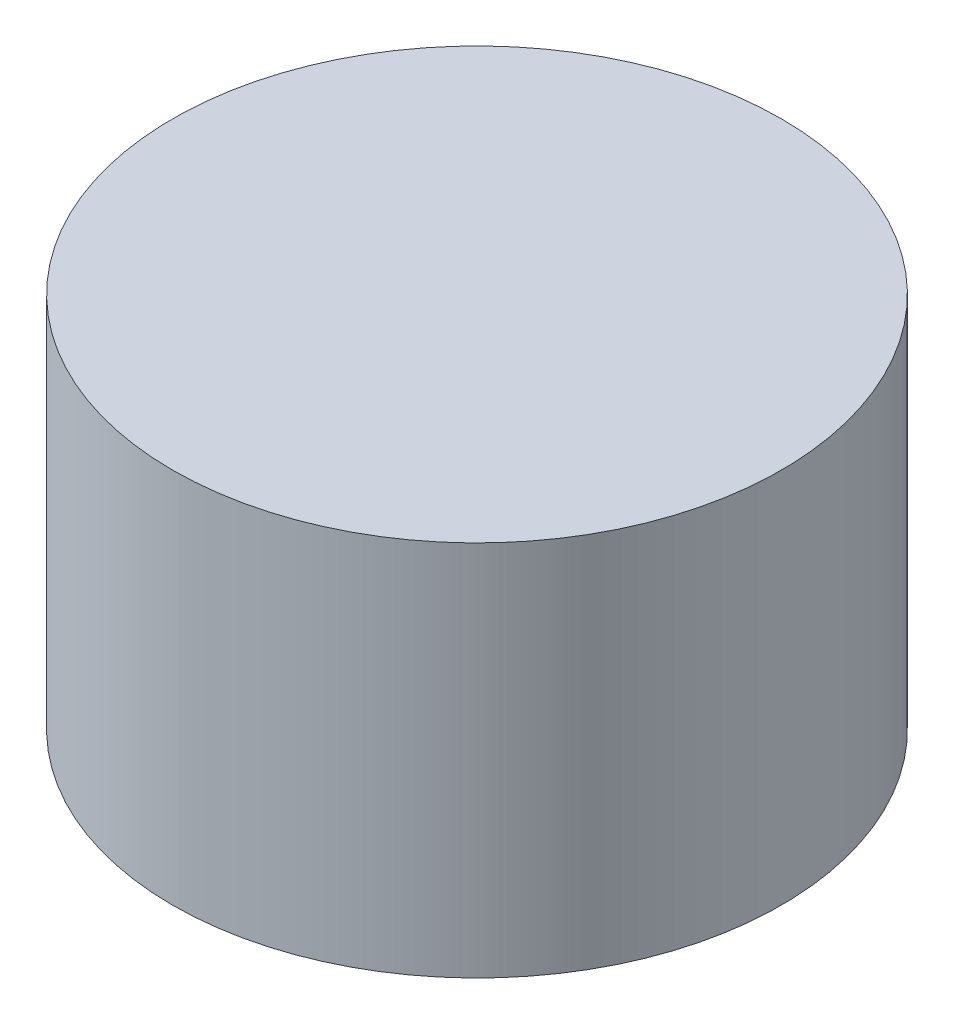
ISO-10303-21;
HEADER;
FILE_DESCRIPTION(('STEP AP214'),'2;1');
FILE_NAME('part.step','',(''),(''),'','','');
FILE_SCHEMA(('AUTOMOTIVE_DESIGN { 1 0 10303 214 1 1 1 1 }'));
ENDSEC;
DATA;
#1=APPLICATION_CONTEXT('core data for automotive mechanical design processes');
#2=APPLICATION_PROTOCOL_DEFINITION('international standard','automotive_design',2000,#1);
#3=PRODUCT_CONTEXT('',#1,'mechanical');
#4=PRODUCT('Part','Part','',(#3));
#5=PRODUCT_RELATED_PRODUCT_CATEGORY('part','',(#4));
#6=PRODUCT_DEFINITION_FORMATION('','',#4);
#7=PRODUCT_DEFINITION_CONTEXT('part definition',#1,'design');
#8=PRODUCT_DEFINITION('design','',#6,#7);
#9=PRODUCT_DEFINITION_SHAPE('','',#8);
#10=(LENGTH_UNIT() NAMED_UNIT(*) SI_UNIT(.MILLI.,.METRE.));
#11=(NAMED_UNIT(*) PLANE_ANGLE_UNIT() SI_UNIT($,.RADIAN.));
#12=(NAMED_UNIT(*) SI_UNIT($,.STERADIAN.) SOLID_ANGLE_UNIT());
#13=UNCERTAINTY_MEASURE_WITH_UNIT(LENGTH_MEASURE(1.E-05),#10,'distance_accuracy_value','');
#14=(GEOMETRIC_REPRESENTATION_CONTEXT(3) GLOBAL_UNCERTAINTY_ASSIGNED_CONTEXT((#13)) GLOBAL_UNIT_ASSIGNED_CONTEXT((#10,
#11,#12)) REPRESENTATION_CONTEXT('',''));
#15=CARTESIAN_POINT('',(0.,0.,0.));
#16=DIRECTION('',(0.,0.,1.));
#17=DIRECTION('',(1.,0.,0.));
#18=AXIS2_PLACEMENT_3D('',#15,#16,#17);
#19=CARTESIAN_POINT('',(0.,13.,0.));
#20=DIRECTION('',(0.,-1.,0.));
#21=DIRECTION('',(0.,0.,-1.));
#22=AXIS2_PLACEMENT_3D('',#19,#20,#21);
#23=CYLINDRICAL_SURFACE('',#22,10.5);
#24=CARTESIAN_POINT('',(0.,13.,0.));
#25=DIRECTION('',(0.,1.,0.));
#26=DIRECTION('',(0.,0.,1.));
#27=AXIS2_PLACEMENT_3D('',#24,#25,#26);
#28=CIRCLE('',#27,10.5);
#29=CARTESIAN_POINT('',(0.,13.,10.5));
#30=VERTEX_POINT('',#29);
#31=EDGE_CURVE('E10',#30,#30,#28,.T.);
#32=ORIENTED_EDGE('',*,*,#31,.F.);
#33=EDGE_LOOP('',(#32));
#34=FACE_BOUND('',#33,.T.);
#35=CARTESIAN_POINT('',(0.,0.,0.));
#36=DIRECTION('',(0.,1.,0.));
#37=DIRECTION('',(0.,0.,1.));
#38=AXIS2_PLACEMENT_3D('',#35,#36,#37);
#39=CIRCLE('',#38,10.5);
#40=CARTESIAN_POINT('',(0.,0.,10.5));
#41=VERTEX_POINT('',#40);
#42=EDGE_CURVE('E41',#41,#41,#39,.T.);
#43=ORIENTED_EDGE('',*,*,#42,.T.);
#44=EDGE_LOOP('',(#43));
#45=FACE_BOUND('',#44,.T.);
#46=ADVANCED_FACE('F34',(#34,#45),#23,.T.);
#47=CARTESIAN_POINT('',(0.,13.,0.));
#48=DIRECTION('',(0.,1.,0.));
#49=DIRECTION('',(0.,0.,1.));
#50=AXIS2_PLACEMENT_3D('',#47,#48,#49);
#51=PLANE('',#50);
#52=ORIENTED_EDGE('',*,*,#31,.T.);
#53=EDGE_LOOP('',(#52));
#54=FACE_BOUND('',#53,.T.);
#55=ADVANCED_FACE('F67',(#54),#51,.T.);
#56=CARTESIAN_POINT('',(0.,0.,0.));
#57=DIRECTION('',(0.,1.,0.));
#58=DIRECTION('',(0.,0.,1.));
#59=AXIS2_PLACEMENT_3D('',#56,#57,#58);
#60=PLANE('',#59);
#61=CARTESIAN_POINT('',(0.,0.,0.));
#62=DIRECTION('',(0.,1.,0.));
#63=DIRECTION('',(0.,0.,1.));
#64=AXIS2_PLACEMENT_3D('',#61,#62,#63);
#65=CIRCLE('',#64,7.5);
#66=CARTESIAN_POINT('',(0.,0.,7.5));
#67=VERTEX_POINT('',#66);
#68=EDGE_CURVE('E37',#67,#67,#65,.T.);
#69=ORIENTED_EDGE('',*,*,#68,.T.);
#70=EDGE_LOOP('',(#69));
#71=FACE_BOUND('',#70,.T.);
#72=ORIENTED_EDGE('',*,*,#42,.F.);
#73=EDGE_LOOP('',(#72));
#74=FACE_BOUND('',#73,.T.);
#75=ADVANCED_FACE('F54',(#71,#74),#60,.F.);
#76=CARTESIAN_POINT('',(0.,0.0490987680048355,0.));
#77=DIRECTION('',(0.,-1.,0.));
#78=DIRECTION('',(0.,0.,-1.));
#79=AXIS2_PLACEMENT_3D('',#76,#77,#78);
#80=CYLINDRICAL_SURFACE('',#79,7.5);
#81=CARTESIAN_POINT('',(0.,8.174080160432,0.));
#82=DIRECTION('',(0.,-1.,0.));
#83=DIRECTION('',(0.,0.,-1.));
#84=AXIS2_PLACEMENT_3D('',#81,#82,#83);
#85=CIRCLE('',#84,7.5);
#86=CARTESIAN_POINT('',(0.,8.174080160432,-7.5));
#87=VERTEX_POINT('',#86);
#88=EDGE_CURVE('E47',#87,#87,#85,.T.);
#89=ORIENTED_EDGE('',*,*,#88,.F.);
#90=EDGE_LOOP('',(#89));
#91=FACE_BOUND('',#90,.T.);
#92=ORIENTED_EDGE('',*,*,#68,.F.);
#93=EDGE_LOOP('',(#92));
#94=FACE_BOUND('',#93,.T.);
#95=ADVANCED_FACE('F57',(#91,#94),#80,.F.);
#96=CARTESIAN_POINT('',(0.,8.174080160432,0.));
#97=DIRECTION('',(0.,1.,0.));
#98=DIRECTION('',(0.,0.,1.));
#99=AXIS2_PLACEMENT_3D('',#96,#97,#98);
#100=PLANE('',#99);
#101=ORIENTED_EDGE('',*,*,#88,.T.);
#102=EDGE_LOOP('',(#101));
#103=FACE_BOUND('',#102,.T.);
#104=ADVANCED_FACE('F59',(#103),#100,.F.);
#105=CLOSED_SHELL('',(#46,#55,#75,#95,#104));
#106=MANIFOLD_SOLID_BREP('B2',#105);
#107=ADVANCED_BREP_SHAPE_REPRESENTATION('',(#18,#106),#14);
#108=SHAPE_DEFINITION_REPRESENTATION(#9,#107);
ENDSEC;
END-ISO-10303-21;
